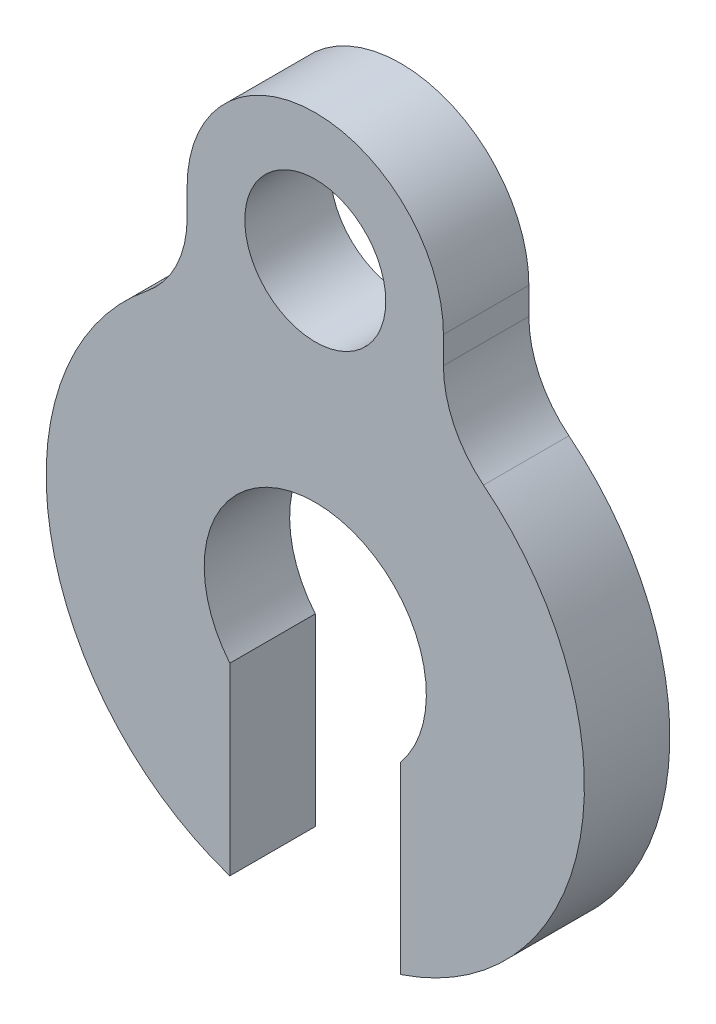
ISO-10303-21;
HEADER;
FILE_DESCRIPTION(('STEP AP214'),'2;1');
FILE_NAME('part.step','',(''),(''),'','','');
FILE_SCHEMA(('AUTOMOTIVE_DESIGN { 1 0 10303 214 1 1 1 1 }'));
ENDSEC;
DATA;
#1=APPLICATION_CONTEXT('core data for automotive mechanical design processes');
#2=APPLICATION_PROTOCOL_DEFINITION('international standard','automotive_design',2000,#1);
#3=PRODUCT_CONTEXT('',#1,'mechanical');
#4=PRODUCT('Part','Part','',(#3));
#5=PRODUCT_RELATED_PRODUCT_CATEGORY('part','',(#4));
#6=PRODUCT_DEFINITION_FORMATION('','',#4);
#7=PRODUCT_DEFINITION_CONTEXT('part definition',#1,'design');
#8=PRODUCT_DEFINITION('design','',#6,#7);
#9=PRODUCT_DEFINITION_SHAPE('','',#8);
#10=(LENGTH_UNIT() NAMED_UNIT(*) SI_UNIT(.MILLI.,.METRE.));
#11=(NAMED_UNIT(*) PLANE_ANGLE_UNIT() SI_UNIT($,.RADIAN.));
#12=(NAMED_UNIT(*) SI_UNIT($,.STERADIAN.) SOLID_ANGLE_UNIT());
#13=UNCERTAINTY_MEASURE_WITH_UNIT(LENGTH_MEASURE(1.E-05),#10,'distance_accuracy_value','');
#14=(GEOMETRIC_REPRESENTATION_CONTEXT(3) GLOBAL_UNCERTAINTY_ASSIGNED_CONTEXT((#13)) GLOBAL_UNIT_ASSIGNED_CONTEXT((#10,
#11,#12)) REPRESENTATION_CONTEXT('',''));
#15=CARTESIAN_POINT('',(0.,0.,0.));
#16=DIRECTION('',(0.,0.,1.));
#17=DIRECTION('',(1.,0.,0.));
#18=AXIS2_PLACEMENT_3D('',#15,#16,#17);
#19=CARTESIAN_POINT('',(-1.27,0.,0.635));
#20=DIRECTION('',(-1.,0.,0.));
#21=DIRECTION('',(0.,0.,1.));
#22=AXIS2_PLACEMENT_3D('',#19,#20,#21);
#23=PLANE('',#22);
#24=DIRECTION('',(0.,1.,0.));
#25=VECTOR('',#24,1.);
#26=CARTESIAN_POINT('',(-1.27,0.,-0.635));
#27=LINE('',#26,#25);
#28=CARTESIAN_POINT('',(-1.27,-3.79356036593594,-0.635));
#29=VERTEX_POINT('',#28);
#30=CARTESIAN_POINT('',(-1.27,-1.0549412305906,-0.635));
#31=VERTEX_POINT('',#30);
#32=EDGE_CURVE('E133',#29,#31,#27,.T.);
#33=ORIENTED_EDGE('',*,*,#32,.T.);
#34=DIRECTION('',(0.,0.,-1.));
#35=VECTOR('',#34,1.);
#36=CARTESIAN_POINT('',(-1.27,-1.0549412305906,0.635));
#37=LINE('',#36,#35);
#38=CARTESIAN_POINT('',(-1.27,-1.0549412305906,0.635));
#39=VERTEX_POINT('',#38);
#40=EDGE_CURVE('E114',#39,#31,#37,.T.);
#41=ORIENTED_EDGE('',*,*,#40,.F.);
#42=DIRECTION('',(0.,1.,0.));
#43=VECTOR('',#42,1.);
#44=CARTESIAN_POINT('',(-1.27,0.,0.635));
#45=LINE('',#44,#43);
#46=CARTESIAN_POINT('',(-1.27,-3.79356036593594,0.635));
#47=VERTEX_POINT('',#46);
#48=EDGE_CURVE('E121',#47,#39,#45,.T.);
#49=ORIENTED_EDGE('',*,*,#48,.F.);
#50=DIRECTION('',(0.,0.,-1.));
#51=VECTOR('',#50,1.);
#52=CARTESIAN_POINT('',(-1.27,-3.79356036593594,0.635));
#53=LINE('',#52,#51);
#54=EDGE_CURVE('E161',#47,#29,#53,.T.);
#55=ORIENTED_EDGE('',*,*,#54,.T.);
#56=EDGE_LOOP('',(#33,#41,#49,#55));
#57=FACE_BOUND('',#56,.T.);
#58=ADVANCED_FACE('F34',(#57),#23,.F.);
#59=CARTESIAN_POINT('',(0.,0.,0.635));
#60=DIRECTION('',(0.,0.,-1.));
#61=DIRECTION('',(-1.,0.,0.));
#62=AXIS2_PLACEMENT_3D('',#59,#60,#61);
#63=CYLINDRICAL_SURFACE('',#62,1.651);
#64=CARTESIAN_POINT('',(0.,0.,-0.635));
#65=DIRECTION('',(0.,0.,1.));
#66=DIRECTION('',(1.,0.,0.));
#67=AXIS2_PLACEMENT_3D('',#64,#65,#66);
#68=CIRCLE('',#67,1.651);
#69=CARTESIAN_POINT('',(1.27000000000001,-1.05494123059058,-0.635));
#70=VERTEX_POINT('',#69);
#71=EDGE_CURVE('E195',#31,#70,#68,.F.);
#72=ORIENTED_EDGE('',*,*,#71,.T.);
#73=DIRECTION('',(0.,0.,-1.));
#74=VECTOR('',#73,1.);
#75=CARTESIAN_POINT('',(1.27000000000001,-1.05494123059058,0.635));
#76=LINE('',#75,#74);
#77=CARTESIAN_POINT('',(1.27000000000001,-1.05494123059058,0.635));
#78=VERTEX_POINT('',#77);
#79=EDGE_CURVE('E116',#78,#70,#76,.T.);
#80=ORIENTED_EDGE('',*,*,#79,.F.);
#81=CARTESIAN_POINT('',(0.,0.,0.635));
#82=DIRECTION('',(0.,0.,1.));
#83=DIRECTION('',(1.,0.,0.));
#84=AXIS2_PLACEMENT_3D('',#81,#82,#83);
#85=CIRCLE('',#84,1.651);
#86=EDGE_CURVE('E109',#39,#78,#85,.F.);
#87=ORIENTED_EDGE('',*,*,#86,.F.);
#88=ORIENTED_EDGE('',*,*,#40,.T.);
#89=EDGE_LOOP('',(#72,#80,#87,#88));
#90=FACE_BOUND('',#89,.T.);
#91=ADVANCED_FACE('F112',(#90),#63,.F.);
#92=CARTESIAN_POINT('',(1.27,0.,0.635));
#93=DIRECTION('',(-1.,0.,0.));
#94=DIRECTION('',(0.,-1.,0.));
#95=AXIS2_PLACEMENT_3D('',#92,#93,#94);
#96=PLANE('',#95);
#97=DIRECTION('',(0.,1.,0.));
#98=VECTOR('',#97,1.);
#99=CARTESIAN_POINT('',(1.27,0.,-0.635));
#100=LINE('',#99,#98);
#101=CARTESIAN_POINT('',(1.27000000000003,-3.79356036593592,-0.635));
#102=VERTEX_POINT('',#101);
#103=EDGE_CURVE('E193',#102,#70,#100,.T.);
#104=ORIENTED_EDGE('',*,*,#103,.F.);
#105=DIRECTION('',(0.,0.,-1.));
#106=VECTOR('',#105,1.);
#107=CARTESIAN_POINT('',(1.27000000000003,-3.79356036593592,0.635));
#108=LINE('',#107,#106);
#109=CARTESIAN_POINT('',(1.27000000000003,-3.79356036593592,0.635));
#110=VERTEX_POINT('',#109);
#111=EDGE_CURVE('E139',#110,#102,#108,.T.);
#112=ORIENTED_EDGE('',*,*,#111,.F.);
#113=DIRECTION('',(0.,1.,0.));
#114=VECTOR('',#113,1.);
#115=CARTESIAN_POINT('',(1.27,0.,0.635));
#116=LINE('',#115,#114);
#117=EDGE_CURVE('E120',#110,#78,#116,.T.);
#118=ORIENTED_EDGE('',*,*,#117,.T.);
#119=ORIENTED_EDGE('',*,*,#79,.T.);
#120=EDGE_LOOP('',(#104,#112,#118,#119));
#121=FACE_BOUND('',#120,.T.);
#122=ADVANCED_FACE('F194',(#121),#96,.T.);
#123=CARTESIAN_POINT('',(0.,0.,0.635));
#124=DIRECTION('',(0.,0.,-1.));
#125=DIRECTION('',(-1.,0.,0.));
#126=AXIS2_PLACEMENT_3D('',#123,#124,#125);
#127=CYLINDRICAL_SURFACE('',#126,4.0005);
#128=CARTESIAN_POINT('',(0.,0.,-0.635));
#129=DIRECTION('',(0.,0.,1.));
#130=DIRECTION('',(1.,0.,0.));
#131=AXIS2_PLACEMENT_3D('',#128,#129,#130);
#132=CIRCLE('',#131,4.0005);
#133=CARTESIAN_POINT('',(2.5003125,3.1228893115741,-0.635));
#134=VERTEX_POINT('',#133);
#135=EDGE_CURVE('E189',#134,#102,#132,.F.);
#136=ORIENTED_EDGE('',*,*,#135,.F.);
#137=DIRECTION('',(0.,0.,-1.));
#138=VECTOR('',#137,1.);
#139=CARTESIAN_POINT('',(2.5003125,3.1228893115741,0.635));
#140=LINE('',#139,#138);
#141=CARTESIAN_POINT('',(2.5003125,3.1228893115741,0.635));
#142=VERTEX_POINT('',#141);
#143=EDGE_CURVE('E49',#134,#142,#140,.F.);
#144=ORIENTED_EDGE('',*,*,#143,.T.);
#145=CARTESIAN_POINT('',(0.,0.,0.635));
#146=DIRECTION('',(0.,0.,1.));
#147=DIRECTION('',(1.,0.,0.));
#148=AXIS2_PLACEMENT_3D('',#145,#146,#147);
#149=CIRCLE('',#148,4.0005);
#150=EDGE_CURVE('E190',#142,#110,#149,.F.);
#151=ORIENTED_EDGE('',*,*,#150,.T.);
#152=ORIENTED_EDGE('',*,*,#111,.T.);
#153=EDGE_LOOP('',(#136,#144,#151,#152));
#154=FACE_BOUND('',#153,.T.);
#155=ADVANCED_FACE('F188',(#154),#127,.T.);
#156=CARTESIAN_POINT('',(1.905,0.,0.635));
#157=DIRECTION('',(1.,0.,0.));
#158=DIRECTION('',(0.,1.,0.));
#159=AXIS2_PLACEMENT_3D('',#156,#157,#158);
#160=PLANE('',#159);
#161=DIRECTION('',(0.,-1.,0.));
#162=VECTOR('',#161,1.);
#163=CARTESIAN_POINT('',(1.905,0.,0.635));
#164=LINE('',#163,#162);
#165=CARTESIAN_POINT('',(1.905,4.7625,0.635));
#166=VERTEX_POINT('',#165);
#167=CARTESIAN_POINT('',(1.905,4.36213110188128,0.635));
#168=VERTEX_POINT('',#167);
#169=EDGE_CURVE('E206',#166,#168,#164,.T.);
#170=ORIENTED_EDGE('',*,*,#169,.T.);
#171=DIRECTION('',(0.,0.,1.));
#172=VECTOR('',#171,1.);
#173=CARTESIAN_POINT('',(1.905,4.36213110188128,-0.635));
#174=LINE('',#173,#172);
#175=CARTESIAN_POINT('',(1.905,4.36213110188128,-0.635));
#176=VERTEX_POINT('',#175);
#177=EDGE_CURVE('E144',#168,#176,#174,.F.);
#178=ORIENTED_EDGE('',*,*,#177,.T.);
#179=DIRECTION('',(0.,-1.,0.));
#180=VECTOR('',#179,1.);
#181=CARTESIAN_POINT('',(1.905,0.,-0.635));
#182=LINE('',#181,#180);
#183=CARTESIAN_POINT('',(1.905,4.7625,-0.635));
#184=VERTEX_POINT('',#183);
#185=EDGE_CURVE('E178',#184,#176,#182,.T.);
#186=ORIENTED_EDGE('',*,*,#185,.F.);
#187=DIRECTION('',(0.,0.,-1.));
#188=VECTOR('',#187,1.);
#189=CARTESIAN_POINT('',(1.905,4.7625,0.635));
#190=LINE('',#189,#188);
#191=EDGE_CURVE('E184',#166,#184,#190,.T.);
#192=ORIENTED_EDGE('',*,*,#191,.F.);
#193=EDGE_LOOP('',(#170,#178,#186,#192));
#194=FACE_BOUND('',#193,.T.);
#195=ADVANCED_FACE('F203',(#194),#160,.T.);
#196=CARTESIAN_POINT('',(0.,4.7625,0.635));
#197=DIRECTION('',(0.,0.,-1.));
#198=DIRECTION('',(-1.,0.,0.));
#199=AXIS2_PLACEMENT_3D('',#196,#197,#198);
#200=CYLINDRICAL_SURFACE('',#199,1.905);
#201=CARTESIAN_POINT('',(0.,4.7625,-0.635));
#202=DIRECTION('',(0.,0.,1.));
#203=DIRECTION('',(1.,0.,0.));
#204=AXIS2_PLACEMENT_3D('',#201,#202,#203);
#205=CIRCLE('',#204,1.905);
#206=CARTESIAN_POINT('',(-1.905,4.7625,-0.635));
#207=VERTEX_POINT('',#206);
#208=EDGE_CURVE('E175',#207,#184,#205,.F.);
#209=ORIENTED_EDGE('',*,*,#208,.F.);
#210=DIRECTION('',(0.,0.,-1.));
#211=VECTOR('',#210,1.);
#212=CARTESIAN_POINT('',(-1.905,4.7625,0.635));
#213=LINE('',#212,#211);
#214=CARTESIAN_POINT('',(-1.905,4.7625,0.635));
#215=VERTEX_POINT('',#214);
#216=EDGE_CURVE('E173',#215,#207,#213,.T.);
#217=ORIENTED_EDGE('',*,*,#216,.F.);
#218=CARTESIAN_POINT('',(0.,4.7625,0.635));
#219=DIRECTION('',(0.,0.,1.));
#220=DIRECTION('',(1.,0.,0.));
#221=AXIS2_PLACEMENT_3D('',#218,#219,#220);
#222=CIRCLE('',#221,1.905);
#223=EDGE_CURVE('E211',#215,#166,#222,.F.);
#224=ORIENTED_EDGE('',*,*,#223,.T.);
#225=ORIENTED_EDGE('',*,*,#191,.T.);
#226=EDGE_LOOP('',(#209,#217,#224,#225));
#227=FACE_BOUND('',#226,.T.);
#228=ADVANCED_FACE('F231',(#227),#200,.T.);
#229=CARTESIAN_POINT('',(-1.905,0.,0.635));
#230=DIRECTION('',(-1.,0.,0.));
#231=DIRECTION('',(0.,0.,1.));
#232=AXIS2_PLACEMENT_3D('',#229,#230,#231);
#233=PLANE('',#232);
#234=DIRECTION('',(0.,1.,0.));
#235=VECTOR('',#234,1.);
#236=CARTESIAN_POINT('',(-1.905,0.,-0.635));
#237=LINE('',#236,#235);
#238=CARTESIAN_POINT('',(-1.905,4.36213110188128,-0.635));
#239=VERTEX_POINT('',#238);
#240=EDGE_CURVE('E167',#239,#207,#237,.T.);
#241=ORIENTED_EDGE('',*,*,#240,.F.);
#242=DIRECTION('',(0.,0.,-1.));
#243=VECTOR('',#242,1.);
#244=CARTESIAN_POINT('',(-1.905,4.36213110188128,0.635));
#245=LINE('',#244,#243);
#246=CARTESIAN_POINT('',(-1.905,4.36213110188128,0.635));
#247=VERTEX_POINT('',#246);
#248=EDGE_CURVE('E137',#239,#247,#245,.F.);
#249=ORIENTED_EDGE('',*,*,#248,.T.);
#250=DIRECTION('',(0.,1.,0.));
#251=VECTOR('',#250,1.);
#252=CARTESIAN_POINT('',(-1.905,0.,0.635));
#253=LINE('',#252,#251);
#254=EDGE_CURVE('E154',#247,#215,#253,.T.);
#255=ORIENTED_EDGE('',*,*,#254,.T.);
#256=ORIENTED_EDGE('',*,*,#216,.T.);
#257=EDGE_LOOP('',(#241,#249,#255,#256));
#258=FACE_BOUND('',#257,.T.);
#259=ADVANCED_FACE('F171',(#258),#233,.T.);
#260=CARTESIAN_POINT('',(0.,4.7625,0.635));
#261=DIRECTION('',(0.,0.,-1.));
#262=DIRECTION('',(-1.,0.,0.));
#263=AXIS2_PLACEMENT_3D('',#260,#261,#262);
#264=CYLINDRICAL_SURFACE('',#263,1.04775);
#265=CARTESIAN_POINT('',(0.,4.7625,0.635));
#266=DIRECTION('',(0.,0.,1.));
#267=DIRECTION('',(1.,0.,0.));
#268=AXIS2_PLACEMENT_3D('',#265,#266,#267);
#269=CIRCLE('',#268,1.04775);
#270=CARTESIAN_POINT('',(1.04775,4.7625,0.635));
#271=VERTEX_POINT('',#270);
#272=EDGE_CURVE('E130',#271,#271,#269,.T.);
#273=ORIENTED_EDGE('',*,*,#272,.T.);
#274=EDGE_LOOP('',(#273));
#275=FACE_BOUND('',#274,.T.);
#276=CARTESIAN_POINT('',(0.,4.7625,-0.635));
#277=DIRECTION('',(0.,0.,1.));
#278=DIRECTION('',(1.,0.,0.));
#279=AXIS2_PLACEMENT_3D('',#276,#277,#278);
#280=CIRCLE('',#279,1.04775);
#281=CARTESIAN_POINT('',(1.04775,4.7625,-0.635));
#282=VERTEX_POINT('',#281);
#283=EDGE_CURVE('E217',#282,#282,#280,.T.);
#284=ORIENTED_EDGE('',*,*,#283,.F.);
#285=EDGE_LOOP('',(#284));
#286=FACE_BOUND('',#285,.T.);
#287=ADVANCED_FACE('F222',(#275,#286),#264,.F.);
#288=CARTESIAN_POINT('',(0.,0.,0.635));
#289=DIRECTION('',(0.,0.,-1.));
#290=DIRECTION('',(-1.,0.,0.));
#291=AXIS2_PLACEMENT_3D('',#288,#289,#290);
#292=CYLINDRICAL_SURFACE('',#291,4.0005);
#293=CARTESIAN_POINT('',(0.,0.,0.635));
#294=DIRECTION('',(0.,0.,1.));
#295=DIRECTION('',(1.,0.,0.));
#296=AXIS2_PLACEMENT_3D('',#293,#294,#295);
#297=CIRCLE('',#296,4.0005);
#298=CARTESIAN_POINT('',(-2.5003125,3.1228893115741,0.635));
#299=VERTEX_POINT('',#298);
#300=EDGE_CURVE('E126',#299,#47,#297,.T.);
#301=ORIENTED_EDGE('',*,*,#300,.F.);
#302=DIRECTION('',(0.,0.,-1.));
#303=VECTOR('',#302,1.);
#304=CARTESIAN_POINT('',(-2.5003125,3.1228893115741,0.635));
#305=LINE('',#304,#303);
#306=CARTESIAN_POINT('',(-2.5003125,3.1228893115741,-0.635));
#307=VERTEX_POINT('',#306);
#308=EDGE_CURVE('E134',#299,#307,#305,.T.);
#309=ORIENTED_EDGE('',*,*,#308,.T.);
#310=CARTESIAN_POINT('',(0.,0.,-0.635));
#311=DIRECTION('',(0.,0.,1.));
#312=DIRECTION('',(1.,0.,0.));
#313=AXIS2_PLACEMENT_3D('',#310,#311,#312);
#314=CIRCLE('',#313,4.0005);
#315=EDGE_CURVE('E169',#307,#29,#314,.T.);
#316=ORIENTED_EDGE('',*,*,#315,.T.);
#317=ORIENTED_EDGE('',*,*,#54,.F.);
#318=EDGE_LOOP('',(#301,#309,#316,#317));
#319=FACE_BOUND('',#318,.T.);
#320=ADVANCED_FACE('F159',(#319),#292,.T.);
#321=CARTESIAN_POINT('',(0.,0.,0.635));
#322=DIRECTION('',(0.,0.,1.));
#323=DIRECTION('',(1.,0.,0.));
#324=AXIS2_PLACEMENT_3D('',#321,#322,#323);
#325=PLANE('',#324);
#326=ORIENTED_EDGE('',*,*,#272,.F.);
#327=EDGE_LOOP('',(#326));
#328=FACE_BOUND('',#327,.T.);
#329=ORIENTED_EDGE('',*,*,#48,.T.);
#330=ORIENTED_EDGE('',*,*,#86,.T.);
#331=ORIENTED_EDGE('',*,*,#117,.F.);
#332=ORIENTED_EDGE('',*,*,#150,.F.);
#333=CARTESIAN_POINT('',(3.4925,4.36213110188128,0.635));
#334=DIRECTION('',(0.,0.,1.));
#335=DIRECTION('',(1.,0.,0.));
#336=AXIS2_PLACEMENT_3D('',#333,#334,#335);
#337=CIRCLE('',#336,1.5875);
#338=EDGE_CURVE('E11',#142,#168,#337,.F.);
#339=ORIENTED_EDGE('',*,*,#338,.T.);
#340=ORIENTED_EDGE('',*,*,#169,.F.);
#341=ORIENTED_EDGE('',*,*,#223,.F.);
#342=ORIENTED_EDGE('',*,*,#254,.F.);
#343=CARTESIAN_POINT('',(-3.4925,4.36213110188128,0.635));
#344=DIRECTION('',(0.,0.,1.));
#345=DIRECTION('',(1.,0.,0.));
#346=AXIS2_PLACEMENT_3D('',#343,#344,#345);
#347=CIRCLE('',#346,1.5875);
#348=EDGE_CURVE('E150',#247,#299,#347,.F.);
#349=ORIENTED_EDGE('',*,*,#348,.T.);
#350=ORIENTED_EDGE('',*,*,#300,.T.);
#351=EDGE_LOOP('',(#329,#330,#331,#332,#339,#340,#341,#342,#349,#350));
#352=FACE_BOUND('',#351,.T.);
#353=ADVANCED_FACE('F124',(#328,#352),#325,.T.);
#354=CARTESIAN_POINT('',(0.,0.,-0.635));
#355=DIRECTION('',(0.,0.,1.));
#356=DIRECTION('',(1.,0.,0.));
#357=AXIS2_PLACEMENT_3D('',#354,#355,#356);
#358=PLANE('',#357);
#359=ORIENTED_EDGE('',*,*,#283,.T.);
#360=EDGE_LOOP('',(#359));
#361=FACE_BOUND('',#360,.T.);
#362=ORIENTED_EDGE('',*,*,#32,.F.);
#363=ORIENTED_EDGE('',*,*,#315,.F.);
#364=CARTESIAN_POINT('',(-3.4925,4.36213110188128,-0.635));
#365=DIRECTION('',(0.,0.,1.));
#366=DIRECTION('',(1.,0.,0.));
#367=AXIS2_PLACEMENT_3D('',#364,#365,#366);
#368=CIRCLE('',#367,1.5875);
#369=EDGE_CURVE('E148',#307,#239,#368,.T.);
#370=ORIENTED_EDGE('',*,*,#369,.T.);
#371=ORIENTED_EDGE('',*,*,#240,.T.);
#372=ORIENTED_EDGE('',*,*,#208,.T.);
#373=ORIENTED_EDGE('',*,*,#185,.T.);
#374=CARTESIAN_POINT('',(3.4925,4.36213110188128,-0.635));
#375=DIRECTION('',(0.,0.,1.));
#376=DIRECTION('',(1.,0.,0.));
#377=AXIS2_PLACEMENT_3D('',#374,#375,#376);
#378=CIRCLE('',#377,1.5875);
#379=EDGE_CURVE('E42',#176,#134,#378,.T.);
#380=ORIENTED_EDGE('',*,*,#379,.T.);
#381=ORIENTED_EDGE('',*,*,#135,.T.);
#382=ORIENTED_EDGE('',*,*,#103,.T.);
#383=ORIENTED_EDGE('',*,*,#71,.F.);
#384=EDGE_LOOP('',(#362,#363,#370,#371,#372,#373,#380,#381,#382,#383));
#385=FACE_BOUND('',#384,.T.);
#386=ADVANCED_FACE('F165',(#361,#385),#358,.F.);
#387=CARTESIAN_POINT('',(-3.4925,4.36213110188128,0.635));
#388=DIRECTION('',(0.,0.,-1.));
#389=DIRECTION('',(-1.,0.,0.));
#390=AXIS2_PLACEMENT_3D('',#387,#388,#389);
#391=CYLINDRICAL_SURFACE('',#390,1.5875);
#392=ORIENTED_EDGE('',*,*,#348,.F.);
#393=ORIENTED_EDGE('',*,*,#248,.F.);
#394=ORIENTED_EDGE('',*,*,#369,.F.);
#395=ORIENTED_EDGE('',*,*,#308,.F.);
#396=EDGE_LOOP('',(#392,#393,#394,#395));
#397=FACE_BOUND('',#396,.T.);
#398=ADVANCED_FACE('F163',(#397),#391,.F.);
#399=CARTESIAN_POINT('',(3.4925,4.36213110188128,0.635));
#400=DIRECTION('',(0.,0.,-1.));
#401=DIRECTION('',(-1.,0.,0.));
#402=AXIS2_PLACEMENT_3D('',#399,#400,#401);
#403=CYLINDRICAL_SURFACE('',#402,1.5875);
#404=ORIENTED_EDGE('',*,*,#338,.F.);
#405=ORIENTED_EDGE('',*,*,#143,.F.);
#406=ORIENTED_EDGE('',*,*,#379,.F.);
#407=ORIENTED_EDGE('',*,*,#177,.F.);
#408=EDGE_LOOP('',(#404,#405,#406,#407));
#409=FACE_BOUND('',#408,.T.);
#410=ADVANCED_FACE('F36',(#409),#403,.F.);
#411=CLOSED_SHELL('',(#58,#91,#122,#155,#195,#228,#259,#287,#320,#353,#386,#398,#410));
#412=MANIFOLD_SOLID_BREP('B2',#411);
#413=ADVANCED_BREP_SHAPE_REPRESENTATION('',(#18,#412),#14);
#414=SHAPE_DEFINITION_REPRESENTATION(#9,#413);
ENDSEC;
END-ISO-10303-21;
